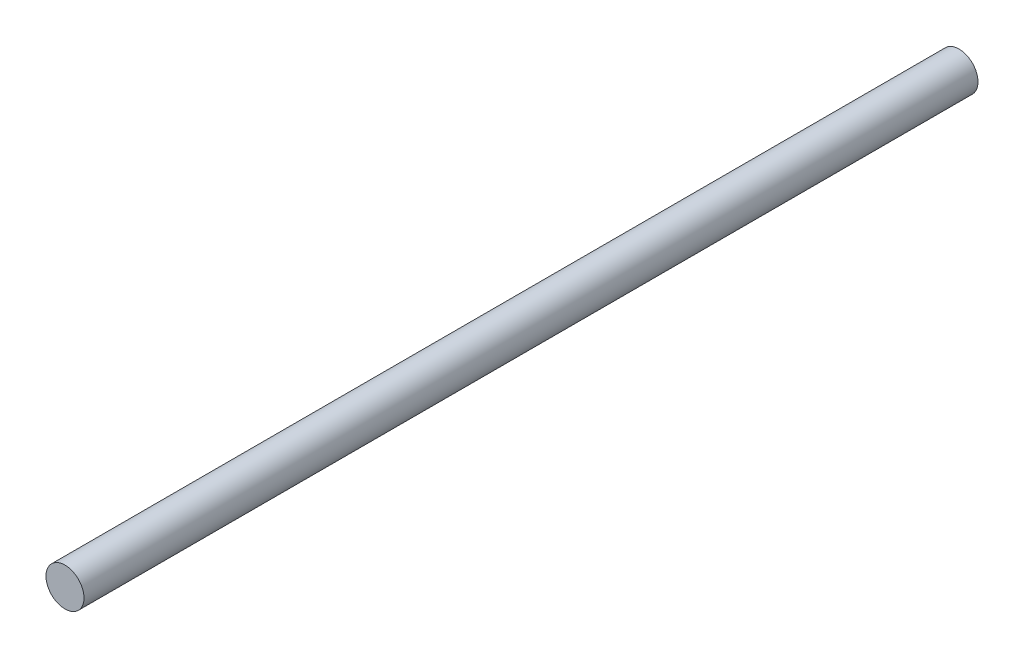
ISO-10303-21;
HEADER;
FILE_DESCRIPTION(('STEP AP214'),'2;1');
FILE_NAME('part.step','',(''),(''),'','','');
FILE_SCHEMA(('AUTOMOTIVE_DESIGN { 1 0 10303 214 1 1 1 1 }'));
ENDSEC;
DATA;
#1=APPLICATION_CONTEXT('core data for automotive mechanical design processes');
#2=APPLICATION_PROTOCOL_DEFINITION('international standard','automotive_design',2000,#1);
#3=PRODUCT_CONTEXT('',#1,'mechanical');
#4=PRODUCT('Part','Part','',(#3));
#5=PRODUCT_RELATED_PRODUCT_CATEGORY('part','',(#4));
#6=PRODUCT_DEFINITION_FORMATION('','',#4);
#7=PRODUCT_DEFINITION_CONTEXT('part definition',#1,'design');
#8=PRODUCT_DEFINITION('design','',#6,#7);
#9=PRODUCT_DEFINITION_SHAPE('','',#8);
#10=(LENGTH_UNIT() NAMED_UNIT(*) SI_UNIT(.MILLI.,.METRE.));
#11=(NAMED_UNIT(*) PLANE_ANGLE_UNIT() SI_UNIT($,.RADIAN.));
#12=(NAMED_UNIT(*) SI_UNIT($,.STERADIAN.) SOLID_ANGLE_UNIT());
#13=UNCERTAINTY_MEASURE_WITH_UNIT(LENGTH_MEASURE(1.E-05),#10,'distance_accuracy_value','');
#14=(GEOMETRIC_REPRESENTATION_CONTEXT(3) GLOBAL_UNCERTAINTY_ASSIGNED_CONTEXT((#13)) GLOBAL_UNIT_ASSIGNED_CONTEXT((#10,
#11,#12)) REPRESENTATION_CONTEXT('',''));
#15=CARTESIAN_POINT('',(0.,0.,0.));
#16=DIRECTION('',(0.,0.,1.));
#17=DIRECTION('',(1.,0.,0.));
#18=AXIS2_PLACEMENT_3D('',#15,#16,#17);
#19=CARTESIAN_POINT('',(0.,0.,94.));
#20=DIRECTION('',(0.,0.,-1.));
#21=DIRECTION('',(-1.,0.,0.));
#22=AXIS2_PLACEMENT_3D('',#19,#20,#21);
#23=CYLINDRICAL_SURFACE('',#22,2.);
#24=CARTESIAN_POINT('',(0.,0.,94.));
#25=DIRECTION('',(0.,0.,1.));
#26=DIRECTION('',(1.,0.,0.));
#27=AXIS2_PLACEMENT_3D('',#24,#25,#26);
#28=CIRCLE('',#27,2.);
#29=CARTESIAN_POINT('',(2.,0.,94.));
#30=VERTEX_POINT('',#29);
#31=EDGE_CURVE('E10',#30,#30,#28,.T.);
#32=ORIENTED_EDGE('',*,*,#31,.F.);
#33=EDGE_LOOP('',(#32));
#34=FACE_BOUND('',#33,.T.);
#35=CARTESIAN_POINT('',(0.,0.,0.));
#36=DIRECTION('',(0.,0.,1.));
#37=DIRECTION('',(1.,0.,0.));
#38=AXIS2_PLACEMENT_3D('',#35,#36,#37);
#39=CIRCLE('',#38,2.);
#40=CARTESIAN_POINT('',(2.,0.,0.));
#41=VERTEX_POINT('',#40);
#42=EDGE_CURVE('E43',#41,#41,#39,.T.);
#43=ORIENTED_EDGE('',*,*,#42,.T.);
#44=EDGE_LOOP('',(#43));
#45=FACE_BOUND('',#44,.T.);
#46=ADVANCED_FACE('F40',(#34,#45),#23,.T.);
#47=CARTESIAN_POINT('',(0.,0.,94.));
#48=DIRECTION('',(0.,0.,1.));
#49=DIRECTION('',(1.,0.,0.));
#50=AXIS2_PLACEMENT_3D('',#47,#48,#49);
#51=PLANE('',#50);
#52=ORIENTED_EDGE('',*,*,#31,.T.);
#53=EDGE_LOOP('',(#52));
#54=FACE_BOUND('',#53,.T.);
#55=ADVANCED_FACE('F57',(#54),#51,.T.);
#56=CARTESIAN_POINT('',(0.,0.,0.));
#57=DIRECTION('',(0.,0.,1.));
#58=DIRECTION('',(1.,0.,0.));
#59=AXIS2_PLACEMENT_3D('',#56,#57,#58);
#60=PLANE('',#59);
#61=ORIENTED_EDGE('',*,*,#42,.F.);
#62=EDGE_LOOP('',(#61));
#63=FACE_BOUND('',#62,.T.);
#64=ADVANCED_FACE('F55',(#63),#60,.F.);
#65=CLOSED_SHELL('',(#46,#55,#64));
#66=MANIFOLD_SOLID_BREP('B2',#65);
#67=ADVANCED_BREP_SHAPE_REPRESENTATION('',(#18,#66),#14);
#68=SHAPE_DEFINITION_REPRESENTATION(#9,#67);
ENDSEC;
END-ISO-10303-21;
